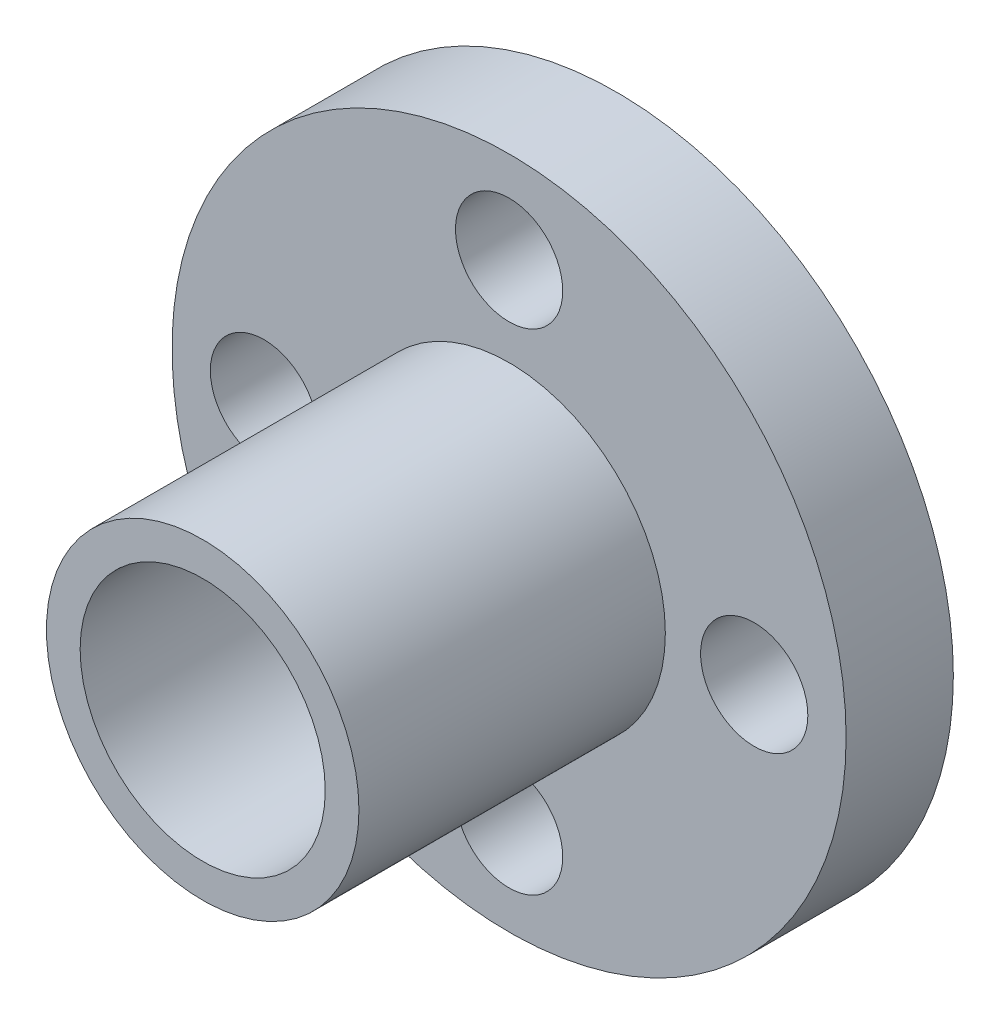
ISO-10303-21;
HEADER;
FILE_DESCRIPTION(('STEP AP214'),'2;1');
FILE_NAME('part.step','',(''),(''),'','','');
FILE_SCHEMA(('AUTOMOTIVE_DESIGN { 1 0 10303 214 1 1 1 1 }'));
ENDSEC;
DATA;
#1=APPLICATION_CONTEXT('core data for automotive mechanical design processes');
#2=APPLICATION_PROTOCOL_DEFINITION('international standard','automotive_design',2000,#1);
#3=PRODUCT_CONTEXT('',#1,'mechanical');
#4=PRODUCT('Part','Part','',(#3));
#5=PRODUCT_RELATED_PRODUCT_CATEGORY('part','',(#4));
#6=PRODUCT_DEFINITION_FORMATION('','',#4);
#7=PRODUCT_DEFINITION_CONTEXT('part definition',#1,'design');
#8=PRODUCT_DEFINITION('design','',#6,#7);
#9=PRODUCT_DEFINITION_SHAPE('','',#8);
#10=(LENGTH_UNIT() NAMED_UNIT(*) SI_UNIT(.MILLI.,.METRE.));
#11=(NAMED_UNIT(*) PLANE_ANGLE_UNIT() SI_UNIT($,.RADIAN.));
#12=(NAMED_UNIT(*) SI_UNIT($,.STERADIAN.) SOLID_ANGLE_UNIT());
#13=UNCERTAINTY_MEASURE_WITH_UNIT(LENGTH_MEASURE(1.E-05),#10,'distance_accuracy_value','');
#14=(GEOMETRIC_REPRESENTATION_CONTEXT(3) GLOBAL_UNCERTAINTY_ASSIGNED_CONTEXT((#13)) GLOBAL_UNIT_ASSIGNED_CONTEXT((#10,
#11,#12)) REPRESENTATION_CONTEXT('',''));
#15=CARTESIAN_POINT('',(0.,0.,0.));
#16=DIRECTION('',(0.,0.,1.));
#17=DIRECTION('',(1.,0.,0.));
#18=AXIS2_PLACEMENT_3D('',#15,#16,#17);
#19=CARTESIAN_POINT('',(0.,0.,3.5));
#20=DIRECTION('',(0.,0.,1.));
#21=DIRECTION('',(1.,0.,0.));
#22=AXIS2_PLACEMENT_3D('',#19,#20,#21);
#23=PLANE('',#22);
#24=CARTESIAN_POINT('',(-8.,0.,3.5));
#25=DIRECTION('',(0.,0.,1.));
#26=DIRECTION('',(-1.,0.,0.));
#27=AXIS2_PLACEMENT_3D('',#24,#25,#26);
#28=CIRCLE('',#27,1.75);
#29=CARTESIAN_POINT('',(-9.75,0.,3.5));
#30=VERTEX_POINT('',#29);
#31=EDGE_CURVE('E69',#30,#30,#28,.T.);
#32=ORIENTED_EDGE('',*,*,#31,.F.);
#33=EDGE_LOOP('',(#32));
#34=FACE_BOUND('',#33,.T.);
#35=CARTESIAN_POINT('',(0.,8.,3.5));
#36=DIRECTION('',(0.,0.,1.));
#37=DIRECTION('',(-1.,0.,0.));
#38=AXIS2_PLACEMENT_3D('',#35,#36,#37);
#39=CIRCLE('',#38,1.75);
#40=CARTESIAN_POINT('',(-1.75,8.,3.5));
#41=VERTEX_POINT('',#40);
#42=EDGE_CURVE('E59',#41,#41,#39,.T.);
#43=ORIENTED_EDGE('',*,*,#42,.F.);
#44=EDGE_LOOP('',(#43));
#45=FACE_BOUND('',#44,.T.);
#46=CARTESIAN_POINT('',(0.,-8.,3.5));
#47=DIRECTION('',(0.,0.,1.));
#48=DIRECTION('',(1.,0.,0.));
#49=AXIS2_PLACEMENT_3D('',#46,#47,#48);
#50=CIRCLE('',#49,1.75);
#51=CARTESIAN_POINT('',(1.75,-8.,3.5));
#52=VERTEX_POINT('',#51);
#53=EDGE_CURVE('E56',#52,#52,#50,.T.);
#54=ORIENTED_EDGE('',*,*,#53,.F.);
#55=EDGE_LOOP('',(#54));
#56=FACE_BOUND('',#55,.T.);
#57=CARTESIAN_POINT('',(8.,0.,3.5));
#58=DIRECTION('',(0.,0.,1.));
#59=DIRECTION('',(1.,0.,0.));
#60=AXIS2_PLACEMENT_3D('',#57,#58,#59);
#61=CIRCLE('',#60,1.75);
#62=CARTESIAN_POINT('',(9.75,0.,3.5));
#63=VERTEX_POINT('',#62);
#64=EDGE_CURVE('E53',#63,#63,#61,.T.);
#65=ORIENTED_EDGE('',*,*,#64,.F.);
#66=EDGE_LOOP('',(#65));
#67=FACE_BOUND('',#66,.T.);
#68=CARTESIAN_POINT('',(0.,0.,3.5));
#69=DIRECTION('',(0.,0.,1.));
#70=DIRECTION('',(1.,0.,0.));
#71=AXIS2_PLACEMENT_3D('',#68,#69,#70);
#72=CIRCLE('',#71,11.);
#73=CARTESIAN_POINT('',(11.,0.,3.5));
#74=VERTEX_POINT('',#73);
#75=EDGE_CURVE('E40',#74,#74,#72,.T.);
#76=ORIENTED_EDGE('',*,*,#75,.T.);
#77=EDGE_LOOP('',(#76));
#78=FACE_BOUND('',#77,.T.);
#79=CARTESIAN_POINT('',(0.,0.,3.5));
#80=DIRECTION('',(0.,0.,1.));
#81=DIRECTION('',(1.,0.,0.));
#82=AXIS2_PLACEMENT_3D('',#79,#80,#81);
#83=CIRCLE('',#82,5.1);
#84=CARTESIAN_POINT('',(5.1,0.,3.5));
#85=VERTEX_POINT('',#84);
#86=EDGE_CURVE('E85',#85,#85,#83,.F.);
#87=ORIENTED_EDGE('',*,*,#86,.T.);
#88=EDGE_LOOP('',(#87));
#89=FACE_BOUND('',#88,.T.);
#90=ADVANCED_FACE('F32',(#34,#45,#56,#67,#78,#89),#23,.T.);
#91=CARTESIAN_POINT('',(0.,0.,0.));
#92=DIRECTION('',(0.,0.,1.));
#93=DIRECTION('',(1.,0.,0.));
#94=AXIS2_PLACEMENT_3D('',#91,#92,#93);
#95=PLANE('',#94);
#96=CARTESIAN_POINT('',(-8.,0.,0.));
#97=DIRECTION('',(0.,0.,1.));
#98=DIRECTION('',(1.,0.,0.));
#99=AXIS2_PLACEMENT_3D('',#96,#97,#98);
#100=CIRCLE('',#99,1.75);
#101=CARTESIAN_POINT('',(-6.25,0.,0.));
#102=VERTEX_POINT('',#101);
#103=EDGE_CURVE('E36',#102,#102,#100,.T.);
#104=ORIENTED_EDGE('',*,*,#103,.T.);
#105=EDGE_LOOP('',(#104));
#106=FACE_BOUND('',#105,.T.);
#107=CARTESIAN_POINT('',(0.,8.,0.));
#108=DIRECTION('',(0.,0.,1.));
#109=DIRECTION('',(1.,0.,0.));
#110=AXIS2_PLACEMENT_3D('',#107,#108,#109);
#111=CIRCLE('',#110,1.75);
#112=CARTESIAN_POINT('',(1.75,8.,0.));
#113=VERTEX_POINT('',#112);
#114=EDGE_CURVE('E57',#113,#113,#111,.T.);
#115=ORIENTED_EDGE('',*,*,#114,.T.);
#116=EDGE_LOOP('',(#115));
#117=FACE_BOUND('',#116,.T.);
#118=CARTESIAN_POINT('',(0.,-8.,0.));
#119=DIRECTION('',(0.,0.,1.));
#120=DIRECTION('',(1.,0.,0.));
#121=AXIS2_PLACEMENT_3D('',#118,#119,#120);
#122=CIRCLE('',#121,1.75);
#123=CARTESIAN_POINT('',(1.75,-8.,0.));
#124=VERTEX_POINT('',#123);
#125=EDGE_CURVE('E54',#124,#124,#122,.T.);
#126=ORIENTED_EDGE('',*,*,#125,.T.);
#127=EDGE_LOOP('',(#126));
#128=FACE_BOUND('',#127,.T.);
#129=CARTESIAN_POINT('',(8.,0.,0.));
#130=DIRECTION('',(0.,0.,1.));
#131=DIRECTION('',(1.,0.,0.));
#132=AXIS2_PLACEMENT_3D('',#129,#130,#131);
#133=CIRCLE('',#132,1.75);
#134=CARTESIAN_POINT('',(9.75,0.,0.));
#135=VERTEX_POINT('',#134);
#136=EDGE_CURVE('E49',#135,#135,#133,.T.);
#137=ORIENTED_EDGE('',*,*,#136,.T.);
#138=EDGE_LOOP('',(#137));
#139=FACE_BOUND('',#138,.T.);
#140=CARTESIAN_POINT('',(0.,0.,0.));
#141=DIRECTION('',(0.,0.,1.));
#142=DIRECTION('',(1.,0.,0.));
#143=AXIS2_PLACEMENT_3D('',#140,#141,#142);
#144=CIRCLE('',#143,11.);
#145=CARTESIAN_POINT('',(11.,0.,0.));
#146=VERTEX_POINT('',#145);
#147=EDGE_CURVE('E45',#146,#146,#144,.T.);
#148=ORIENTED_EDGE('',*,*,#147,.F.);
#149=EDGE_LOOP('',(#148));
#150=FACE_BOUND('',#149,.T.);
#151=CARTESIAN_POINT('',(0.,0.,0.));
#152=DIRECTION('',(0.,0.,1.));
#153=DIRECTION('',(1.,0.,0.));
#154=AXIS2_PLACEMENT_3D('',#151,#152,#153);
#155=CIRCLE('',#154,5.1);
#156=CARTESIAN_POINT('',(5.1,0.,0.));
#157=VERTEX_POINT('',#156);
#158=EDGE_CURVE('E10',#157,#157,#155,.F.);
#159=ORIENTED_EDGE('',*,*,#158,.F.);
#160=EDGE_LOOP('',(#159));
#161=FACE_BOUND('',#160,.T.);
#162=ADVANCED_FACE('F93',(#106,#117,#128,#139,#150,#161),#95,.F.);
#163=CARTESIAN_POINT('',(0.,0.,3.5));
#164=DIRECTION('',(0.,0.,-1.));
#165=DIRECTION('',(-1.,0.,0.));
#166=AXIS2_PLACEMENT_3D('',#163,#164,#165);
#167=CYLINDRICAL_SURFACE('',#166,11.);
#168=ORIENTED_EDGE('',*,*,#75,.F.);
#169=EDGE_LOOP('',(#168));
#170=FACE_BOUND('',#169,.T.);
#171=ORIENTED_EDGE('',*,*,#147,.T.);
#172=EDGE_LOOP('',(#171));
#173=FACE_BOUND('',#172,.T.);
#174=ADVANCED_FACE('F34',(#170,#173),#167,.T.);
#175=CARTESIAN_POINT('',(0.,0.,13.5));
#176=DIRECTION('',(0.,0.,-1.));
#177=DIRECTION('',(-1.,0.,0.));
#178=AXIS2_PLACEMENT_3D('',#175,#176,#177);
#179=CYLINDRICAL_SURFACE('',#178,5.1);
#180=CARTESIAN_POINT('',(0.,0.,-1.5));
#181=DIRECTION('',(0.,0.,1.));
#182=DIRECTION('',(1.,0.,0.));
#183=AXIS2_PLACEMENT_3D('',#180,#181,#182);
#184=CIRCLE('',#183,5.1);
#185=CARTESIAN_POINT('',(5.1,0.,-1.5));
#186=VERTEX_POINT('',#185);
#187=EDGE_CURVE('E76',#186,#186,#184,.T.);
#188=ORIENTED_EDGE('',*,*,#187,.T.);
#189=EDGE_LOOP('',(#188));
#190=FACE_BOUND('',#189,.T.);
#191=ORIENTED_EDGE('',*,*,#158,.T.);
#192=EDGE_LOOP('',(#191));
#193=FACE_BOUND('',#192,.T.);
#194=ADVANCED_FACE('F101',(#190,#193),#179,.T.);
#195=CARTESIAN_POINT('',(0.,0.,-1.5));
#196=DIRECTION('',(0.,0.,1.));
#197=DIRECTION('',(1.,0.,0.));
#198=AXIS2_PLACEMENT_3D('',#195,#196,#197);
#199=PLANE('',#198);
#200=CARTESIAN_POINT('',(0.,0.,-1.5));
#201=DIRECTION('',(0.,0.,1.));
#202=DIRECTION('',(1.,0.,0.));
#203=AXIS2_PLACEMENT_3D('',#200,#201,#202);
#204=CIRCLE('',#203,4.);
#205=CARTESIAN_POINT('',(4.,0.,-1.5));
#206=VERTEX_POINT('',#205);
#207=EDGE_CURVE('E52',#206,#206,#204,.T.);
#208=ORIENTED_EDGE('',*,*,#207,.T.);
#209=EDGE_LOOP('',(#208));
#210=FACE_BOUND('',#209,.T.);
#211=ORIENTED_EDGE('',*,*,#187,.F.);
#212=EDGE_LOOP('',(#211));
#213=FACE_BOUND('',#212,.T.);
#214=ADVANCED_FACE('F110',(#210,#213),#199,.F.);
#215=CARTESIAN_POINT('',(0.,0.,0.));
#216=DIRECTION('',(0.,0.,1.));
#217=DIRECTION('',(1.,0.,0.));
#218=AXIS2_PLACEMENT_3D('',#215,#216,#217);
#219=CYLINDRICAL_SURFACE('',#218,4.);
#220=ORIENTED_EDGE('',*,*,#207,.F.);
#221=EDGE_LOOP('',(#220));
#222=FACE_BOUND('',#221,.T.);
#223=CARTESIAN_POINT('',(0.,0.,13.5));
#224=DIRECTION('',(0.,0.,1.));
#225=DIRECTION('',(1.,0.,0.));
#226=AXIS2_PLACEMENT_3D('',#223,#224,#225);
#227=CIRCLE('',#226,4.);
#228=CARTESIAN_POINT('',(4.,0.,13.5));
#229=VERTEX_POINT('',#228);
#230=EDGE_CURVE('E79',#229,#229,#227,.T.);
#231=ORIENTED_EDGE('',*,*,#230,.T.);
#232=EDGE_LOOP('',(#231));
#233=FACE_BOUND('',#232,.T.);
#234=ADVANCED_FACE('F106',(#222,#233),#219,.F.);
#235=CARTESIAN_POINT('',(0.,0.,13.5));
#236=DIRECTION('',(0.,0.,1.));
#237=DIRECTION('',(1.,0.,0.));
#238=AXIS2_PLACEMENT_3D('',#235,#236,#237);
#239=PLANE('',#238);
#240=CARTESIAN_POINT('',(0.,0.,13.5));
#241=DIRECTION('',(0.,0.,1.));
#242=DIRECTION('',(1.,0.,0.));
#243=AXIS2_PLACEMENT_3D('',#240,#241,#242);
#244=CIRCLE('',#243,5.1);
#245=CARTESIAN_POINT('',(5.1,0.,13.5));
#246=VERTEX_POINT('',#245);
#247=EDGE_CURVE('E82',#246,#246,#244,.T.);
#248=ORIENTED_EDGE('',*,*,#247,.T.);
#249=EDGE_LOOP('',(#248));
#250=FACE_BOUND('',#249,.T.);
#251=ORIENTED_EDGE('',*,*,#230,.F.);
#252=EDGE_LOOP('',(#251));
#253=FACE_BOUND('',#252,.T.);
#254=ADVANCED_FACE('F109',(#250,#253),#239,.T.);
#255=ORIENTED_EDGE('',*,*,#86,.F.);
#256=EDGE_LOOP('',(#255));
#257=FACE_BOUND('',#256,.T.);
#258=ORIENTED_EDGE('',*,*,#247,.F.);
#259=EDGE_LOOP('',(#258));
#260=FACE_BOUND('',#259,.T.);
#261=ADVANCED_FACE('F112',(#257,#260),#179,.T.);
#262=CARTESIAN_POINT('',(8.,0.,-1.5));
#263=DIRECTION('',(0.,0.,1.));
#264=DIRECTION('',(1.,0.,0.));
#265=AXIS2_PLACEMENT_3D('',#262,#263,#264);
#266=CYLINDRICAL_SURFACE('',#265,1.75);
#267=ORIENTED_EDGE('',*,*,#64,.T.);
#268=EDGE_LOOP('',(#267));
#269=FACE_BOUND('',#268,.T.);
#270=ORIENTED_EDGE('',*,*,#136,.F.);
#271=EDGE_LOOP('',(#270));
#272=FACE_BOUND('',#271,.T.);
#273=ADVANCED_FACE('F115',(#269,#272),#266,.F.);
#274=CARTESIAN_POINT('',(0.,-8.,-1.5));
#275=DIRECTION('',(0.,0.,1.));
#276=DIRECTION('',(1.,0.,0.));
#277=AXIS2_PLACEMENT_3D('',#274,#275,#276);
#278=CYLINDRICAL_SURFACE('',#277,1.75);
#279=ORIENTED_EDGE('',*,*,#53,.T.);
#280=EDGE_LOOP('',(#279));
#281=FACE_BOUND('',#280,.T.);
#282=ORIENTED_EDGE('',*,*,#125,.F.);
#283=EDGE_LOOP('',(#282));
#284=FACE_BOUND('',#283,.T.);
#285=ADVANCED_FACE('F125',(#281,#284),#278,.F.);
#286=CARTESIAN_POINT('',(0.,8.,-1.5));
#287=DIRECTION('',(0.,0.,1.));
#288=DIRECTION('',(1.,0.,0.));
#289=AXIS2_PLACEMENT_3D('',#286,#287,#288);
#290=CYLINDRICAL_SURFACE('',#289,1.75);
#291=ORIENTED_EDGE('',*,*,#42,.T.);
#292=EDGE_LOOP('',(#291));
#293=FACE_BOUND('',#292,.T.);
#294=ORIENTED_EDGE('',*,*,#114,.F.);
#295=EDGE_LOOP('',(#294));
#296=FACE_BOUND('',#295,.T.);
#297=ADVANCED_FACE('F129',(#293,#296),#290,.F.);
#298=CARTESIAN_POINT('',(-8.,0.,-1.5));
#299=DIRECTION('',(0.,0.,1.));
#300=DIRECTION('',(1.,0.,0.));
#301=AXIS2_PLACEMENT_3D('',#298,#299,#300);
#302=CYLINDRICAL_SURFACE('',#301,1.75);
#303=ORIENTED_EDGE('',*,*,#31,.T.);
#304=EDGE_LOOP('',(#303));
#305=FACE_BOUND('',#304,.T.);
#306=ORIENTED_EDGE('',*,*,#103,.F.);
#307=EDGE_LOOP('',(#306));
#308=FACE_BOUND('',#307,.T.);
#309=ADVANCED_FACE('F133',(#305,#308),#302,.F.);
#310=CLOSED_SHELL('',(#90,#162,#174,#194,#214,#234,#254,#261,#273,#285,#297,#309));
#311=MANIFOLD_SOLID_BREP('B2',#310);
#312=ADVANCED_BREP_SHAPE_REPRESENTATION('',(#18,#311),#14);
#313=SHAPE_DEFINITION_REPRESENTATION(#9,#312);
ENDSEC;
END-ISO-10303-21;
